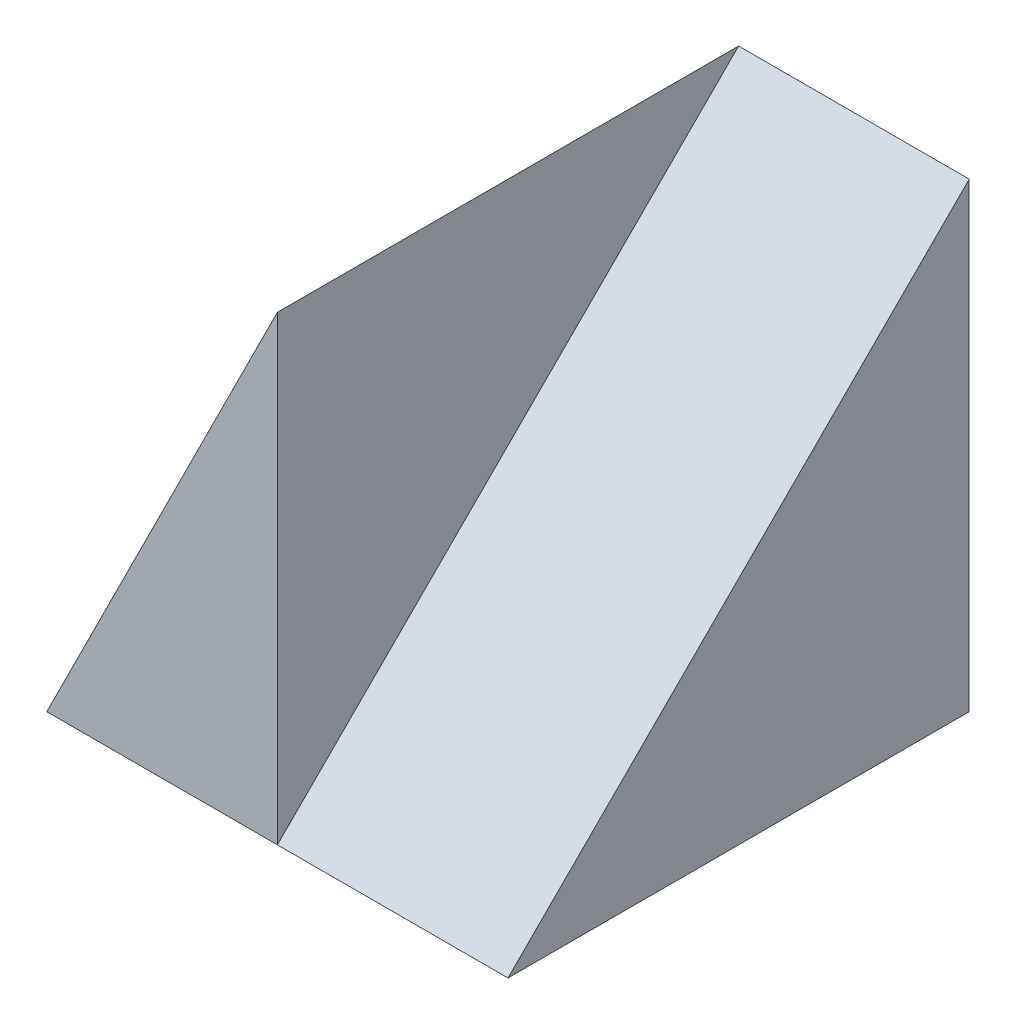
ISO-10303-21;
HEADER;
FILE_DESCRIPTION(('STEP AP214'),'2;1');
FILE_NAME('part.step','',(''),(''),'','','');
FILE_SCHEMA(('AUTOMOTIVE_DESIGN { 1 0 10303 214 1 1 1 1 }'));
ENDSEC;
DATA;
#1=APPLICATION_CONTEXT('core data for automotive mechanical design processes');
#2=APPLICATION_PROTOCOL_DEFINITION('international standard','automotive_design',2000,#1);
#3=PRODUCT_CONTEXT('',#1,'mechanical');
#4=PRODUCT('Part','Part','',(#3));
#5=PRODUCT_RELATED_PRODUCT_CATEGORY('part','',(#4));
#6=PRODUCT_DEFINITION_FORMATION('','',#4);
#7=PRODUCT_DEFINITION_CONTEXT('part definition',#1,'design');
#8=PRODUCT_DEFINITION('design','',#6,#7);
#9=PRODUCT_DEFINITION_SHAPE('','',#8);
#10=(LENGTH_UNIT() NAMED_UNIT(*) SI_UNIT(.MILLI.,.METRE.));
#11=(NAMED_UNIT(*) PLANE_ANGLE_UNIT() SI_UNIT($,.RADIAN.));
#12=(NAMED_UNIT(*) SI_UNIT($,.STERADIAN.) SOLID_ANGLE_UNIT());
#13=UNCERTAINTY_MEASURE_WITH_UNIT(LENGTH_MEASURE(1.E-05),#10,'distance_accuracy_value','');
#14=(GEOMETRIC_REPRESENTATION_CONTEXT(3) GLOBAL_UNCERTAINTY_ASSIGNED_CONTEXT((#13)) GLOBAL_UNIT_ASSIGNED_CONTEXT((#10,
#11,#12)) REPRESENTATION_CONTEXT('',''));
#15=CARTESIAN_POINT('',(0.,0.,0.));
#16=DIRECTION('',(0.,0.,1.));
#17=DIRECTION('',(1.,0.,0.));
#18=AXIS2_PLACEMENT_3D('',#15,#16,#17);
#19=CARTESIAN_POINT('',(0.,0.,40.));
#20=DIRECTION('',(0.,0.,-1.));
#21=DIRECTION('',(-1.,0.,0.));
#22=AXIS2_PLACEMENT_3D('',#19,#20,#21);
#23=PLANE('',#22);
#24=DIRECTION('',(0.,-1.,0.));
#25=VECTOR('',#24,1.);
#26=CARTESIAN_POINT('',(20.,0.,40.));
#27=LINE('',#26,#25);
#28=CARTESIAN_POINT('',(20.,40.,40.));
#29=VERTEX_POINT('',#28);
#30=CARTESIAN_POINT('',(20.,0.,40.));
#31=VERTEX_POINT('',#30);
#32=EDGE_CURVE('E76',#29,#31,#27,.T.);
#33=ORIENTED_EDGE('',*,*,#32,.F.);
#34=DIRECTION('',(0.447213595499958,0.894427190999916,0.));
#35=VECTOR('',#34,1.);
#36=CARTESIAN_POINT('',(0.,0.,40.));
#37=LINE('',#36,#35);
#38=CARTESIAN_POINT('',(0.,0.,40.));
#39=VERTEX_POINT('',#38);
#40=EDGE_CURVE('E85',#39,#29,#37,.T.);
#41=ORIENTED_EDGE('',*,*,#40,.F.);
#42=DIRECTION('',(1.,0.,0.));
#43=VECTOR('',#42,1.);
#44=CARTESIAN_POINT('',(0.,0.,40.));
#45=LINE('',#44,#43);
#46=EDGE_CURVE('E87',#39,#31,#45,.T.);
#47=ORIENTED_EDGE('',*,*,#46,.T.);
#48=EDGE_LOOP('',(#33,#41,#47));
#49=FACE_BOUND('',#48,.T.);
#50=ADVANCED_FACE('F33',(#49),#23,.F.);
#51=CARTESIAN_POINT('',(0.,0.,40.));
#52=DIRECTION('',(0.,1.,0.));
#53=DIRECTION('',(0.,0.,1.));
#54=AXIS2_PLACEMENT_3D('',#51,#52,#53);
#55=PLANE('',#54);
#56=DIRECTION('',(1.,0.,0.));
#57=VECTOR('',#56,1.);
#58=CARTESIAN_POINT('',(0.,0.,0.));
#59=LINE('',#58,#57);
#60=CARTESIAN_POINT('',(0.,0.,0.));
#61=VERTEX_POINT('',#60);
#62=CARTESIAN_POINT('',(40.,0.,0.));
#63=VERTEX_POINT('',#62);
#64=EDGE_CURVE('E55',#61,#63,#59,.T.);
#65=ORIENTED_EDGE('',*,*,#64,.T.);
#66=DIRECTION('',(0.,0.,-1.));
#67=VECTOR('',#66,1.);
#68=CARTESIAN_POINT('',(40.,0.,40.));
#69=LINE('',#68,#67);
#70=CARTESIAN_POINT('',(40.,0.,40.));
#71=VERTEX_POINT('',#70);
#72=EDGE_CURVE('E41',#71,#63,#69,.T.);
#73=ORIENTED_EDGE('',*,*,#72,.F.);
#74=DIRECTION('',(1.,0.,0.));
#75=VECTOR('',#74,1.);
#76=CARTESIAN_POINT('',(20.,0.,40.));
#77=LINE('',#76,#75);
#78=EDGE_CURVE('E91',#31,#71,#77,.T.);
#79=ORIENTED_EDGE('',*,*,#78,.F.);
#80=ORIENTED_EDGE('',*,*,#46,.F.);
#81=DIRECTION('',(0.,0.,-1.));
#82=VECTOR('',#81,1.);
#83=CARTESIAN_POINT('',(0.,0.,40.));
#84=LINE('',#83,#82);
#85=EDGE_CURVE('E11',#39,#61,#84,.T.);
#86=ORIENTED_EDGE('',*,*,#85,.T.);
#87=EDGE_LOOP('',(#65,#73,#79,#80,#86));
#88=FACE_BOUND('',#87,.T.);
#89=ADVANCED_FACE('F35',(#88),#55,.F.);
#90=CARTESIAN_POINT('',(40.,0.,40.));
#91=DIRECTION('',(-1.,0.,0.));
#92=DIRECTION('',(0.,0.,1.));
#93=AXIS2_PLACEMENT_3D('',#90,#91,#92);
#94=PLANE('',#93);
#95=DIRECTION('',(0.,1.,0.));
#96=VECTOR('',#95,1.);
#97=CARTESIAN_POINT('',(40.,0.,0.));
#98=LINE('',#97,#96);
#99=CARTESIAN_POINT('',(40.,40.,0.));
#100=VERTEX_POINT('',#99);
#101=EDGE_CURVE('E99',#63,#100,#98,.T.);
#102=ORIENTED_EDGE('',*,*,#101,.T.);
#103=DIRECTION('',(0.,0.707106781186548,-0.707106781186548));
#104=VECTOR('',#103,1.);
#105=CARTESIAN_POINT('',(40.,20.,20.));
#106=LINE('',#105,#104);
#107=EDGE_CURVE('E88',#71,#100,#106,.T.);
#108=ORIENTED_EDGE('',*,*,#107,.F.);
#109=ORIENTED_EDGE('',*,*,#72,.T.);
#110=EDGE_LOOP('',(#102,#108,#109));
#111=FACE_BOUND('',#110,.T.);
#112=ADVANCED_FACE('F105',(#111),#94,.F.);
#113=CARTESIAN_POINT('',(0.,0.,0.));
#114=DIRECTION('',(0.,0.,-1.));
#115=DIRECTION('',(-1.,0.,0.));
#116=AXIS2_PLACEMENT_3D('',#113,#114,#115);
#117=PLANE('',#116);
#118=DIRECTION('',(0.447213595499958,0.894427190999916,0.));
#119=VECTOR('',#118,1.);
#120=CARTESIAN_POINT('',(0.,0.,0.));
#121=LINE('',#120,#119);
#122=CARTESIAN_POINT('',(20.,40.,0.));
#123=VERTEX_POINT('',#122);
#124=EDGE_CURVE('E80',#61,#123,#121,.T.);
#125=ORIENTED_EDGE('',*,*,#124,.T.);
#126=DIRECTION('',(-1.,0.,0.));
#127=VECTOR('',#126,1.);
#128=CARTESIAN_POINT('',(0.,40.,0.));
#129=LINE('',#128,#127);
#130=EDGE_CURVE('E97',#100,#123,#129,.T.);
#131=ORIENTED_EDGE('',*,*,#130,.F.);
#132=ORIENTED_EDGE('',*,*,#101,.F.);
#133=ORIENTED_EDGE('',*,*,#64,.F.);
#134=EDGE_LOOP('',(#125,#131,#132,#133));
#135=FACE_BOUND('',#134,.T.);
#136=ADVANCED_FACE('F109',(#135),#117,.T.);
#137=CARTESIAN_POINT('',(0.,0.,0.));
#138=DIRECTION('',(0.894427190999916,-0.447213595499958,0.));
#139=DIRECTION('',(0.447213595499958,0.894427190999916,0.));
#140=AXIS2_PLACEMENT_3D('',#137,#138,#139);
#141=PLANE('',#140);
#142=ORIENTED_EDGE('',*,*,#40,.T.);
#143=DIRECTION('',(0.,0.,1.));
#144=VECTOR('',#143,1.);
#145=CARTESIAN_POINT('',(20.,40.,0.));
#146=LINE('',#145,#144);
#147=EDGE_CURVE('E73',#123,#29,#146,.T.);
#148=ORIENTED_EDGE('',*,*,#147,.F.);
#149=ORIENTED_EDGE('',*,*,#124,.F.);
#150=ORIENTED_EDGE('',*,*,#85,.F.);
#151=EDGE_LOOP('',(#142,#148,#149,#150));
#152=FACE_BOUND('',#151,.T.);
#153=ADVANCED_FACE('F90',(#152),#141,.F.);
#154=CARTESIAN_POINT('',(20.,20.,20.));
#155=DIRECTION('',(0.,-0.707106781186548,-0.707106781186548));
#156=DIRECTION('',(0.,0.707106781186548,-0.707106781186548));
#157=AXIS2_PLACEMENT_3D('',#154,#155,#156);
#158=PLANE('',#157);
#159=ORIENTED_EDGE('',*,*,#107,.T.);
#160=ORIENTED_EDGE('',*,*,#130,.T.);
#161=DIRECTION('',(0.,0.707106781186548,-0.707106781186548));
#162=VECTOR('',#161,1.);
#163=CARTESIAN_POINT('',(20.,20.,20.));
#164=LINE('',#163,#162);
#165=EDGE_CURVE('E48',#31,#123,#164,.T.);
#166=ORIENTED_EDGE('',*,*,#165,.F.);
#167=ORIENTED_EDGE('',*,*,#78,.T.);
#168=EDGE_LOOP('',(#159,#160,#166,#167));
#169=FACE_BOUND('',#168,.T.);
#170=ADVANCED_FACE('F111',(#169),#158,.F.);
#171=CARTESIAN_POINT('',(20.,0.,0.));
#172=DIRECTION('',(1.,0.,0.));
#173=DIRECTION('',(0.,0.,-1.));
#174=AXIS2_PLACEMENT_3D('',#171,#172,#173);
#175=PLANE('',#174);
#176=ORIENTED_EDGE('',*,*,#147,.T.);
#177=ORIENTED_EDGE('',*,*,#32,.T.);
#178=ORIENTED_EDGE('',*,*,#165,.T.);
#179=EDGE_LOOP('',(#176,#177,#178));
#180=FACE_BOUND('',#179,.T.);
#181=ADVANCED_FACE('F75',(#180),#175,.T.);
#182=CLOSED_SHELL('',(#50,#89,#112,#136,#153,#170,#181));
#183=MANIFOLD_SOLID_BREP('B2',#182);
#184=ADVANCED_BREP_SHAPE_REPRESENTATION('',(#18,#183),#14);
#185=SHAPE_DEFINITION_REPRESENTATION(#9,#184);
ENDSEC;
END-ISO-10303-21;
